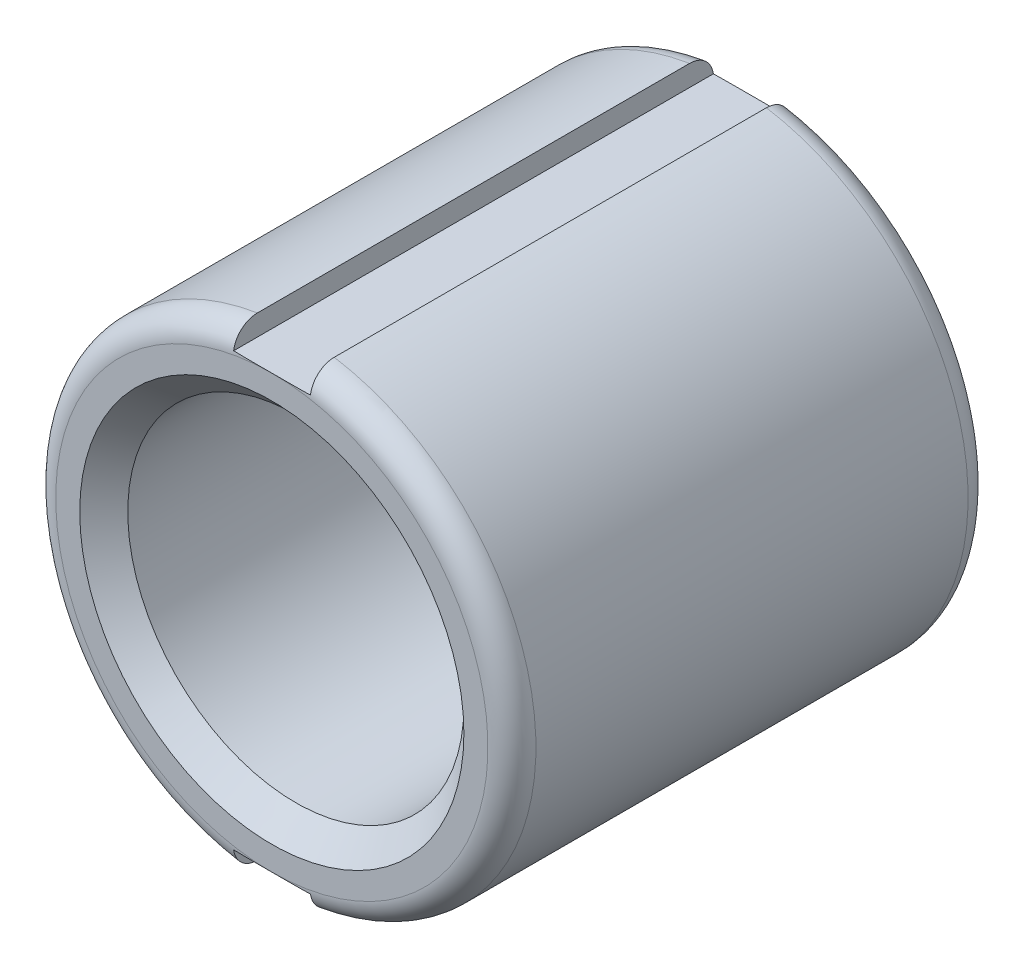
ISO-10303-21;
HEADER;
FILE_DESCRIPTION(('STEP AP214'),'2;1');
FILE_NAME('part.step','',(''),(''),'','','');
FILE_SCHEMA(('AUTOMOTIVE_DESIGN { 1 0 10303 214 1 1 1 1 }'));
ENDSEC;
DATA;
#1=APPLICATION_CONTEXT('core data for automotive mechanical design processes');
#2=APPLICATION_PROTOCOL_DEFINITION('international standard','automotive_design',2000,#1);
#3=PRODUCT_CONTEXT('',#1,'mechanical');
#4=PRODUCT('Part','Part','',(#3));
#5=PRODUCT_RELATED_PRODUCT_CATEGORY('part','',(#4));
#6=PRODUCT_DEFINITION_FORMATION('','',#4);
#7=PRODUCT_DEFINITION_CONTEXT('part definition',#1,'design');
#8=PRODUCT_DEFINITION('design','',#6,#7);
#9=PRODUCT_DEFINITION_SHAPE('','',#8);
#10=(LENGTH_UNIT() NAMED_UNIT(*) SI_UNIT(.MILLI.,.METRE.));
#11=(NAMED_UNIT(*) PLANE_ANGLE_UNIT() SI_UNIT($,.RADIAN.));
#12=(NAMED_UNIT(*) SI_UNIT($,.STERADIAN.) SOLID_ANGLE_UNIT());
#13=UNCERTAINTY_MEASURE_WITH_UNIT(LENGTH_MEASURE(1.E-05),#10,'distance_accuracy_value','');
#14=(GEOMETRIC_REPRESENTATION_CONTEXT(3) GLOBAL_UNCERTAINTY_ASSIGNED_CONTEXT((#13)) GLOBAL_UNIT_ASSIGNED_CONTEXT((#10,
#11,#12)) REPRESENTATION_CONTEXT('',''));
#15=CARTESIAN_POINT('',(0.,0.,0.));
#16=DIRECTION('',(0.,0.,1.));
#17=DIRECTION('',(1.,0.,0.));
#18=AXIS2_PLACEMENT_3D('',#15,#16,#17);
#19=CARTESIAN_POINT('',(0.,0.,0.));
#20=DIRECTION('',(0.,0.,1.));
#21=DIRECTION('',(1.,0.,0.));
#22=AXIS2_PLACEMENT_3D('',#19,#20,#21);
#23=CYLINDRICAL_SURFACE('',#22,3.5);
#24=CARTESIAN_POINT('',(0.,0.,0.500000668296252));
#25=DIRECTION('',(0.,0.,-1.));
#26=DIRECTION('',(-1.,0.,0.));
#27=AXIS2_PLACEMENT_3D('',#24,#25,#26);
#28=CIRCLE('',#27,3.50000155617636);
#29=CARTESIAN_POINT('',(-3.50000155617636,0.,0.500000668296252));
#30=VERTEX_POINT('',#29);
#31=EDGE_CURVE('E158',#30,#30,#28,.T.);
#32=ORIENTED_EDGE('',*,*,#31,.T.);
#33=EDGE_LOOP('',(#32));
#34=FACE_BOUND('',#33,.T.);
#35=CARTESIAN_POINT('',(0.,0.,9.49999933169465));
#36=DIRECTION('',(0.,0.,1.));
#37=DIRECTION('',(1.,0.,0.));
#38=AXIS2_PLACEMENT_3D('',#35,#36,#37);
#39=CIRCLE('',#38,3.50000155611951);
#40=CARTESIAN_POINT('',(3.50000155611951,0.,9.49999933169465));
#41=VERTEX_POINT('',#40);
#42=EDGE_CURVE('E109',#41,#41,#39,.T.);
#43=ORIENTED_EDGE('',*,*,#42,.T.);
#44=EDGE_LOOP('',(#43));
#45=FACE_BOUND('',#44,.T.);
#46=ADVANCED_FACE('F17',(#34,#45),#23,.F.);
#47=CARTESIAN_POINT('',(0.,0.,0.));
#48=DIRECTION('',(0.,0.,1.));
#49=DIRECTION('',(1.,0.,0.));
#50=AXIS2_PLACEMENT_3D('',#47,#48,#49);
#51=CYLINDRICAL_SURFACE('',#50,5.);
#52=CARTESIAN_POINT('',(0.,0.,9.5));
#53=DIRECTION('',(0.,0.,1.));
#54=DIRECTION('',(-0.999985814409762,0.0053264415179918,0.));
#55=AXIS2_PLACEMENT_3D('',#52,#53,#54);
#56=CIRCLE('',#55,5.);
#57=CARTESIAN_POINT('',(0.8,-4.93558507170123,9.5));
#58=VERTEX_POINT('',#57);
#59=CARTESIAN_POINT('',(0.8,4.93558507170123,9.5));
#60=VERTEX_POINT('',#59);
#61=EDGE_CURVE('E90',#58,#60,#56,.T.);
#62=ORIENTED_EDGE('',*,*,#61,.F.);
#63=DIRECTION('',(0.,0.,-1.));
#64=VECTOR('',#63,1.);
#65=CARTESIAN_POINT('',(0.8,-4.93558507170122,10.));
#66=LINE('',#65,#64);
#67=CARTESIAN_POINT('',(0.8,-4.93558507170123,0.5));
#68=VERTEX_POINT('',#67);
#69=EDGE_CURVE('E93',#58,#68,#66,.T.);
#70=ORIENTED_EDGE('',*,*,#69,.T.);
#71=CARTESIAN_POINT('',(0.,0.,0.5));
#72=DIRECTION('',(0.,0.,1.));
#73=DIRECTION('',(-0.999971373855159,-0.00756647012979169,0.));
#74=AXIS2_PLACEMENT_3D('',#71,#72,#73);
#75=CIRCLE('',#74,5.);
#76=CARTESIAN_POINT('',(0.8,4.93558507170123,0.5));
#77=VERTEX_POINT('',#76);
#78=EDGE_CURVE('E295',#77,#68,#75,.F.);
#79=ORIENTED_EDGE('',*,*,#78,.F.);
#80=DIRECTION('',(0.,0.,-1.));
#81=VECTOR('',#80,1.);
#82=CARTESIAN_POINT('',(0.8,4.93558507170122,10.));
#83=LINE('',#82,#81);
#84=EDGE_CURVE('E96',#77,#60,#83,.F.);
#85=ORIENTED_EDGE('',*,*,#84,.T.);
#86=EDGE_LOOP('',(#62,#70,#79,#85));
#87=FACE_BOUND('',#86,.T.);
#88=ADVANCED_FACE('F92',(#87),#51,.T.);
#89=CARTESIAN_POINT('',(0.8,-5.5,10.));
#90=DIRECTION('',(1.,0.,0.));
#91=DIRECTION('',(0.,0.,-1.));
#92=AXIS2_PLACEMENT_3D('',#89,#90,#91);
#93=PLANE('',#92);
#94=CARTESIAN_POINT('',(0.799999999999999,-4.93558507170123,0.5));
#95=CARTESIAN_POINT('',(0.799999999999999,-4.93561032535587,0.472142239938519));
#96=CARTESIAN_POINT('',(0.799999999999999,-4.9332280990744,0.444293560125993));
#97=CARTESIAN_POINT('',(0.8,-4.92383695020117,0.389416305297648));
#98=CARTESIAN_POINT('',(0.800000000000001,-4.91683289458156,0.362386898836657));
#99=CARTESIAN_POINT('',(0.800000000000001,-4.89838214932041,0.309878409520228));
#100=CARTESIAN_POINT('',(0.8,-4.88693378503542,0.28439991524956));
#101=CARTESIAN_POINT('',(0.8,-4.85994797345873,0.235717714075063));
#102=CARTESIAN_POINT('',(0.800000000000002,-4.84441127027912,0.212513594269689));
#103=CARTESIAN_POINT('',(0.800000000000002,-4.80960868399099,0.168890140455869));
#104=CARTESIAN_POINT('',(0.800000000000001,-4.79032319320717,0.148486455443453));
#105=CARTESIAN_POINT('',(0.799999999999999,-4.74863618241635,0.111157692405801));
#106=CARTESIAN_POINT('',(0.799999999999999,-4.72623435165118,0.0942329617157905));
#107=CARTESIAN_POINT('',(0.799999999999999,-4.67864143853591,0.0641049158333548));
#108=CARTESIAN_POINT('',(0.799999999999999,-4.65341750629682,0.0509535491889362));
#109=CARTESIAN_POINT('',(0.800000000000001,-4.6011736085027,0.0290311680150615));
#110=CARTESIAN_POINT('',(0.800000000000002,-4.5741565608496,0.0202532255802647));
#111=CARTESIAN_POINT('',(0.800000000000001,-4.53121938397591,0.0101181231965108));
#112=CARTESIAN_POINT('',(0.800000000000001,-4.51565627527713,0.0071954524475714));
#113=CARTESIAN_POINT('',(0.799999999999999,-4.5,0.00500345930988489));
#114=B_SPLINE_CURVE_WITH_KNOTS('',3,(#94,#95,#96,#97,#98,#99,#100,#101,#102,#103,#104,#105,#106,
#107,#108,#109,#110,#111,#112,#113),.UNSPECIFIED.,.F.,.F.,(4,2,2,2,2,2,2,2,2,4),(0.,
0.0834582261465901,0.166828707373061,0.2502306336609,0.333617390583446,0.417452636878405,
0.501296249137186,0.586244120600249,0.671056995563331,0.718490993678133),.UNSPECIFIED.);
#115=CARTESIAN_POINT('',(0.8,-4.5,0.00500345930988505));
#116=VERTEX_POINT('',#115);
#117=EDGE_CURVE('E107',#68,#116,#114,.T.);
#118=ORIENTED_EDGE('',*,*,#117,.F.);
#119=ORIENTED_EDGE('',*,*,#69,.F.);
#120=CARTESIAN_POINT('',(0.799999999999999,-4.50000000000001,9.99499654069011));
#121=CARTESIAN_POINT('',(0.800000000003339,-4.52845008995948,9.99102726234701));
#122=CARTESIAN_POINT('',(0.80000000000206,-4.55655799753854,9.98463378322027));
#123=CARTESIAN_POINT('',(0.79999999999794,-4.611312990404,9.96725562326724));
#124=CARTESIAN_POINT('',(0.799999999995099,-4.63796026705732,9.95627154551976));
#125=CARTESIAN_POINT('',(0.799999999995528,-4.68904531495508,9.92995796288271));
#126=CARTESIAN_POINT('',(0.799999999998802,-4.7134813483106,9.91462507858352));
#127=CARTESIAN_POINT('',(0.800000000001197,-4.75938912980065,9.88004391144214));
#128=CARTESIAN_POINT('',(0.800000000000321,-4.78086227872704,9.86079748956176));
#129=CARTESIAN_POINT('',(0.799999999999685,-4.82002026059259,9.8191179415494));
#130=CARTESIAN_POINT('',(0.799999999999915,-4.83773905813528,9.79671673527788));
#131=CARTESIAN_POINT('',(0.800000000000085,-4.86910243522778,9.74922441106862));
#132=CARTESIAN_POINT('',(0.800000000000024,-4.88274752932843,9.7241336333961));
#133=CARTESIAN_POINT('',(0.79999999999998,-4.90540197180442,9.67231304598103));
#134=CARTESIAN_POINT('',(0.799999999999995,-4.9144665136445,9.64560731737832));
#135=CARTESIAN_POINT('',(0.800000000000005,-4.92791606131762,9.59108622263885));
#136=CARTESIAN_POINT('',(0.799999999999999,-4.93231064733838,9.56327325011705));
#137=CARTESIAN_POINT('',(0.799999999999998,-4.93516503994077,9.52355829081837));
#138=CARTESIAN_POINT('',(0.799999999999998,-4.93558824722471,9.51177579488754));
#139=CARTESIAN_POINT('',(0.800000000000001,-4.93558507170123,9.5));
#140=B_SPLINE_CURVE_WITH_KNOTS('',3,(#120,#121,#122,#123,#124,#125,#126,#127,#128,#129,#130,
#131,#132,#133,#134,#135,#136,#137,#138,#139),.UNSPECIFIED.,.F.,.F.,(4,2,2,2,2,2,2,2,2,4),(0.,
0.0860724300575327,0.172133556110195,0.25826174341409,0.344349070497942,0.429620769168096,
0.514881692580213,0.599089183650414,0.683123591666845,0.718461359070084),.UNSPECIFIED.);
#141=CARTESIAN_POINT('',(0.800000000000001,-4.5,9.99499654069011));
#142=VERTEX_POINT('',#141);
#143=EDGE_CURVE('E101',#142,#58,#140,.T.);
#144=ORIENTED_EDGE('',*,*,#143,.F.);
#145=DIRECTION('',(0.,0.,1.));
#146=VECTOR('',#145,1.);
#147=CARTESIAN_POINT('',(0.800000000000002,-4.5,10.));
#148=LINE('',#147,#146);
#149=EDGE_CURVE('E294',#142,#116,#148,.F.);
#150=ORIENTED_EDGE('',*,*,#149,.T.);
#151=EDGE_LOOP('',(#118,#119,#144,#150));
#152=FACE_BOUND('',#151,.T.);
#153=ADVANCED_FACE('F104',(#152),#93,.F.);
#154=CARTESIAN_POINT('',(0.,0.,9.99999999993406));
#155=DIRECTION('',(0.,0.,1.));
#156=DIRECTION('',(1.,0.,0.));
#157=AXIS2_PLACEMENT_3D('',#154,#155,#156);
#158=CONICAL_SURFACE('',#157,4.00000254199995,0.785398481094791);
#159=ORIENTED_EDGE('',*,*,#42,.F.);
#160=EDGE_LOOP('',(#159));
#161=FACE_BOUND('',#160,.T.);
#162=CARTESIAN_POINT('',(0.,0.,9.99999999999091));
#163=DIRECTION('',(0.,0.,1.));
#164=DIRECTION('',(1.,0.,0.));
#165=AXIS2_PLACEMENT_3D('',#162,#163,#164);
#166=CIRCLE('',#165,4.00000254205679);
#167=CARTESIAN_POINT('',(4.00000254205679,0.,9.99999999999091));
#168=VERTEX_POINT('',#167);
#169=EDGE_CURVE('E348',#168,#168,#166,.F.);
#170=ORIENTED_EDGE('',*,*,#169,.F.);
#171=EDGE_LOOP('',(#170));
#172=FACE_BOUND('',#171,.T.);
#173=ADVANCED_FACE('F136',(#161,#172),#158,.F.);
#174=CARTESIAN_POINT('',(0.,0.,9.5));
#175=DIRECTION('',(0.,0.,1.));
#176=DIRECTION('',(-0.999985814409762,0.0053264415179918,0.));
#177=AXIS2_PLACEMENT_3D('',#174,#175,#176);
#178=TOROIDAL_SURFACE('',#177,4.5,0.5);
#179=ORIENTED_EDGE('',*,*,#61,.T.);
#180=CARTESIAN_POINT('',(0.800000000000001,4.93558507170123,9.5));
#181=CARTESIAN_POINT('',(0.800000000000001,4.93561032535586,9.52785776006148));
#182=CARTESIAN_POINT('',(0.800000000000001,4.9332280990744,9.55570643987401));
#183=CARTESIAN_POINT('',(0.799999999999999,4.92383695020116,9.61058369470235));
#184=CARTESIAN_POINT('',(0.799999999999999,4.91683289458156,9.63761310116334));
#185=CARTESIAN_POINT('',(0.799999999999999,4.8983821493204,9.69012159047977));
#186=CARTESIAN_POINT('',(0.800000000000001,4.88693378503541,9.71560008475044));
#187=CARTESIAN_POINT('',(0.799999999999999,4.85994797345873,9.76428228592494));
#188=CARTESIAN_POINT('',(0.799999999999996,4.84441127027911,9.78748640573031));
#189=CARTESIAN_POINT('',(0.799999999999995,4.80960868399099,9.83110985954413));
#190=CARTESIAN_POINT('',(0.799999999999998,4.79032319320717,9.85151354455655));
#191=CARTESIAN_POINT('',(0.800000000000002,4.74863618241635,9.8888423075942));
#192=CARTESIAN_POINT('',(0.800000000000003,4.72623435165118,9.90576703828421));
#193=CARTESIAN_POINT('',(0.800000000000002,4.67864143853591,9.93589508416664));
#194=CARTESIAN_POINT('',(0.799999999999999,4.65341750629682,9.94904645081106));
#195=CARTESIAN_POINT('',(0.8,4.6011736085027,9.97096883198494));
#196=CARTESIAN_POINT('',(0.800000000000004,4.5741565608496,9.97974677441973));
#197=CARTESIAN_POINT('',(0.800000000000004,4.53121938397591,9.98988187680349));
#198=CARTESIAN_POINT('',(0.800000000000003,4.51565627527713,9.99280454755243));
#199=CARTESIAN_POINT('',(0.8,4.50000000000001,9.99499654069011));
#200=B_SPLINE_CURVE_WITH_KNOTS('',3,(#180,#181,#182,#183,#184,#185,#186,#187,#188,#189,#190,
#191,#192,#193,#194,#195,#196,#197,#198,#199),.UNSPECIFIED.,.F.,.F.,(4,2,2,2,2,2,2,2,2,4),(0.,
0.0834582261465907,0.166828707373061,0.2502306336609,0.333617390583446,0.417452636878405,
0.501296249137185,0.586244120600247,0.671056995563331,0.718490993678126),.UNSPECIFIED.);
#201=CARTESIAN_POINT('',(0.800000000000001,4.5,9.99499654069011));
#202=VERTEX_POINT('',#201);
#203=EDGE_CURVE('E124',#60,#202,#200,.T.);
#204=ORIENTED_EDGE('',*,*,#203,.T.);
#205=CARTESIAN_POINT('',(0.800000000000002,4.5,9.99499654069012));
#206=CARTESIAN_POINT('',(0.733344461334272,4.5,9.99663365195973));
#207=CARTESIAN_POINT('',(0.666680461312616,4.5,9.99770096514002));
#208=CARTESIAN_POINT('',(0.533346087742878,4.5,9.99912184018491));
#209=CARTESIAN_POINT('',(0.466675714444805,4.5,9.9994754233789));
#210=CARTESIAN_POINT('',(0.333336097882169,4.5,9.99989472730253));
#211=CARTESIAN_POINT('',(0.26666685461492,4.5,9.99996045208806));
#212=CARTESIAN_POINT('',(0.133326303280786,4.5,10.0000000824359));
#213=CARTESIAN_POINT('',(0.066654995211742,4.5,9.99997398525395));
#214=CARTESIAN_POINT('',(-1.64804799254942E-05,4.5,10.));
#215=B_SPLINE_CURVE_WITH_KNOTS('',3,(#205,#206,#207,#208,#209,#210,#211,#212,#213,#214),
.UNSPECIFIED.,.F.,.F.,(4,2,2,2,4),(0.,0.200016874708182,0.400027771944378,0.60003585104753,
0.80004990770689),.UNSPECIFIED.);
#216=CARTESIAN_POINT('',(-1.64804799263147E-05,4.50000021942539,9.99999999999994));
#217=VERTEX_POINT('',#216);
#218=EDGE_CURVE('E116',#202,#217,#215,.T.);
#219=ORIENTED_EDGE('',*,*,#218,.T.);
#220=CARTESIAN_POINT('',(0.,0.,9.99999999999991));
#221=DIRECTION('',(0.,0.,-1.));
#222=DIRECTION('',(-3.66232863427582E-06,0.999999999993293,0.));
#223=AXIS2_PLACEMENT_3D('',#220,#221,#222);
#224=CIRCLE('',#223,4.50000029300371);
#225=CARTESIAN_POINT('',(1.62758198530875E-05,-4.50000021820692,9.99999999999994));
#226=VERTEX_POINT('',#225);
#227=EDGE_CURVE('E149',#226,#217,#224,.F.);
#228=ORIENTED_EDGE('',*,*,#227,.F.);
#229=CARTESIAN_POINT('',(1.62758198533338E-05,-4.5,10.));
#230=CARTESIAN_POINT('',(0.0666850218145762,-4.5,9.99997398959712));
#231=CARTESIAN_POINT('',(0.133353600268118,-4.5,10.000000082437));
#232=CARTESIAN_POINT('',(0.266688692360293,-4.5,9.99996043270109));
#233=CARTESIAN_POINT('',(0.333355206001086,-4.5,9.99989469286998));
#234=CARTESIAN_POINT('',(0.466689363027923,-4.5,9.99947535481787));
#235=CARTESIAN_POINT('',(0.533357006416649,-4.5,9.99912175254108));
#236=CARTESIAN_POINT('',(0.666685920379369,-4.5,9.99770087981886));
#237=CARTESIAN_POINT('',(0.733347190703352,-4.5,9.99663358804452));
#238=CARTESIAN_POINT('',(0.800000000000001,-4.5,9.99499654069012));
#239=B_SPLINE_CURVE_WITH_KNOTS('',3,(#229,#230,#231,#232,#233,#234,#235,#236,#237,#238),
.UNSPECIFIED.,.F.,.F.,(4,2,2,2,4),(0.,0.200005867720801,0.400005757922168,0.600008466035796,
0.800017151584641),.UNSPECIFIED.);
#240=EDGE_CURVE('E114',#226,#142,#239,.T.);
#241=ORIENTED_EDGE('',*,*,#240,.T.);
#242=ORIENTED_EDGE('',*,*,#143,.T.);
#243=EDGE_LOOP('',(#179,#204,#219,#228,#241,#242));
#244=FACE_BOUND('',#243,.T.);
#245=ADVANCED_FACE('F111',(#244),#178,.T.);
#246=CARTESIAN_POINT('',(0.8,4.5,10.));
#247=DIRECTION('',(1.,0.,0.));
#248=DIRECTION('',(0.,0.,-1.));
#249=AXIS2_PLACEMENT_3D('',#246,#247,#248);
#250=PLANE('',#249);
#251=ORIENTED_EDGE('',*,*,#203,.F.);
#252=ORIENTED_EDGE('',*,*,#84,.F.);
#253=CARTESIAN_POINT('',(0.8,4.5,0.00500345930988478));
#254=CARTESIAN_POINT('',(0.800000000003342,4.52845008995948,0.0089727376529909));
#255=CARTESIAN_POINT('',(0.800000000002062,4.55655799753853,0.0153662167797315));
#256=CARTESIAN_POINT('',(0.799999999997939,4.611312990404,0.0327443767327543));
#257=CARTESIAN_POINT('',(0.799999999995096,4.63796026705732,0.0437284544802352));
#258=CARTESIAN_POINT('',(0.799999999995525,4.68904531495508,0.0700420371172882));
#259=CARTESIAN_POINT('',(0.799999999998801,4.7134813483106,0.0853749214164788));
#260=CARTESIAN_POINT('',(0.800000000001198,4.75938912980065,0.119956088557856));
#261=CARTESIAN_POINT('',(0.80000000000032,4.78086227872704,0.139202510438233));
#262=CARTESIAN_POINT('',(0.799999999999684,4.82002026059259,0.180882058450603));
#263=CARTESIAN_POINT('',(0.799999999999915,4.83773905813528,0.203283264722114));
#264=CARTESIAN_POINT('',(0.800000000000085,4.86910243522778,0.250775588931374));
#265=CARTESIAN_POINT('',(0.800000000000024,4.88274752932843,0.275866366603897));
#266=CARTESIAN_POINT('',(0.799999999999979,4.90540197180442,0.327686954018964));
#267=CARTESIAN_POINT('',(0.799999999999993,4.9144665136445,0.354392682621678));
#268=CARTESIAN_POINT('',(0.800000000000007,4.92791606131762,0.40891377736115));
#269=CARTESIAN_POINT('',(0.800000000000005,4.93231064733838,0.436726749882947));
#270=CARTESIAN_POINT('',(0.800000000000001,4.93516503994077,0.476441709181632));
#271=CARTESIAN_POINT('',(0.8,4.93558824722471,0.488224205112462));
#272=CARTESIAN_POINT('',(0.799999999999999,4.93558507170123,0.5));
#273=B_SPLINE_CURVE_WITH_KNOTS('',3,(#253,#254,#255,#256,#257,#258,#259,#260,#261,#262,#263,
#264,#265,#266,#267,#268,#269,#270,#271,#272),.UNSPECIFIED.,.F.,.F.,(4,2,2,2,2,2,2,2,2,4),(0.,
0.0860724300575342,0.172133556110198,0.258261743414094,0.344349070497948,0.429620769168102,
0.514881692580217,0.599089183650419,0.68312359166685,0.718461359070095),.UNSPECIFIED.);
#274=CARTESIAN_POINT('',(0.8,4.5,0.00500345930988478));
#275=VERTEX_POINT('',#274);
#276=EDGE_CURVE('E161',#275,#77,#273,.T.);
#277=ORIENTED_EDGE('',*,*,#276,.F.);
#278=DIRECTION('',(0.,0.,-1.));
#279=VECTOR('',#278,1.);
#280=CARTESIAN_POINT('',(0.8,4.5,10.));
#281=LINE('',#280,#279);
#282=EDGE_CURVE('E356',#275,#202,#281,.F.);
#283=ORIENTED_EDGE('',*,*,#282,.T.);
#284=EDGE_LOOP('',(#251,#252,#277,#283));
#285=FACE_BOUND('',#284,.T.);
#286=ADVANCED_FACE('F135',(#285),#250,.F.);
#287=CARTESIAN_POINT('',(0.,0.,5.6843418860808E-11));
#288=DIRECTION('',(0.,0.,-1.));
#289=DIRECTION('',(-1.,0.,0.));
#290=AXIS2_PLACEMENT_3D('',#287,#288,#289);
#291=CONICAL_SURFACE('',#290,4.00000254217048,0.785398481151634);
#292=ORIENTED_EDGE('',*,*,#31,.F.);
#293=EDGE_LOOP('',(#292));
#294=FACE_BOUND('',#293,.T.);
#295=CARTESIAN_POINT('',(0.,0.,5.6843418860808E-11));
#296=DIRECTION('',(0.,0.,-1.));
#297=DIRECTION('',(-1.,0.,0.));
#298=AXIS2_PLACEMENT_3D('',#295,#296,#297);
#299=CIRCLE('',#298,4.00000254217048);
#300=CARTESIAN_POINT('',(-4.00000254217048,0.,5.6843418860808E-11));
#301=VERTEX_POINT('',#300);
#302=EDGE_CURVE('E261',#301,#301,#299,.T.);
#303=ORIENTED_EDGE('',*,*,#302,.T.);
#304=EDGE_LOOP('',(#303));
#305=FACE_BOUND('',#304,.T.);
#306=ADVANCED_FACE('F288',(#294,#305),#291,.F.);
#307=CARTESIAN_POINT('',(0.,0.,0.5));
#308=DIRECTION('',(0.,0.,1.));
#309=DIRECTION('',(-0.999971373855159,-0.00756647012979169,0.));
#310=AXIS2_PLACEMENT_3D('',#307,#308,#309);
#311=TOROIDAL_SURFACE('',#310,4.5,0.5);
#312=CARTESIAN_POINT('',(0.799999999999999,-4.5,0.00500345930988467));
#313=CARTESIAN_POINT('',(0.733345836201673,-4.5,0.00336638023626906));
#314=CARTESIAN_POINT('',(0.666683211212941,-4.5,0.00229907783861924));
#315=CARTESIAN_POINT('',(0.533351587815675,-4.5,0.000878203963372319));
#316=CARTESIAN_POINT('',(0.466682589657151,-4.5,0.000524611156621396));
#317=CARTESIAN_POINT('',(0.333345723231111,-4.5,0.000105290041417163));
#318=CARTESIAN_POINT('',(0.26667785496091,-4.5,3.95576771291826E-05));
#319=CARTESIAN_POINT('',(0.133340053615356,-4.5,-8.24366977575884E-08));
#320=CARTESIAN_POINT('',(0.0666701205378419,-4.5,2.60125581932159E-05));
#321=CARTESIAN_POINT('',(1.98787304230897E-08,-4.5,0.));
#322=B_SPLINE_CURVE_WITH_KNOTS('',3,(#312,#313,#314,#315,#316,#317,#318,#319,#320,#321),
.UNSPECIFIED.,.F.,.F.,(4,2,2,2,4),(0.,0.200012749576009,0.400019521698549,0.600023475799261,
0.80003340743766),.UNSPECIFIED.);
#323=CARTESIAN_POINT('',(1.98787300884372E-08,-4.50000000014344,0.));
#324=VERTEX_POINT('',#323);
#325=EDGE_CURVE('E339',#116,#324,#322,.T.);
#326=ORIENTED_EDGE('',*,*,#325,.T.);
#327=CARTESIAN_POINT('',(0.,0.,0.));
#328=DIRECTION('',(0.,0.,1.));
#329=DIRECTION('',(4.41749556354919E-09,-1.,0.));
#330=AXIS2_PLACEMENT_3D('',#327,#328,#329);
#331=CIRCLE('',#330,4.50000000019725);
#332=CARTESIAN_POINT('',(4.50000000008891,0.,0.));
#333=VERTEX_POINT('',#332);
#334=EDGE_CURVE('E253',#324,#333,#331,.T.);
#335=ORIENTED_EDGE('',*,*,#334,.T.);
#336=CARTESIAN_POINT('',(0.,0.,0.));
#337=DIRECTION('',(0.,0.,1.));
#338=DIRECTION('',(1.,0.,0.));
#339=AXIS2_PLACEMENT_3D('',#336,#337,#338);
#340=CIRCLE('',#339,4.5000000000528);
#341=CARTESIAN_POINT('',(-2.20444814632359E-08,4.50000000010738,0.));
#342=VERTEX_POINT('',#341);
#343=EDGE_CURVE('E247',#333,#342,#340,.T.);
#344=ORIENTED_EDGE('',*,*,#343,.T.);
#345=CARTESIAN_POINT('',(-2.20444806072612E-08,4.5,0.));
#346=CARTESIAN_POINT('',(0.0666700821082385,4.5,2.60125637518218E-05));
#347=CARTESIAN_POINT('',(0.133340018679256,4.5,-8.24366963839623E-08));
#348=CARTESIAN_POINT('',(0.266677827011831,4.5,3.95576523166573E-05));
#349=CARTESIAN_POINT('',(0.33334569877555,4.5,0.000105289997348502));
#350=CARTESIAN_POINT('',(0.466682572188987,4.5,0.000524611068873394));
#351=CARTESIAN_POINT('',(0.53335157384139,4.5,0.000878203851201231));
#352=CARTESIAN_POINT('',(0.666683204226145,4.5,0.00229907772942093));
#353=CARTESIAN_POINT('',(0.733345832708486,4.5,0.00336638015446722));
#354=CARTESIAN_POINT('',(0.8,4.5,0.00500345930988478));
#355=B_SPLINE_CURVE_WITH_KNOTS('',3,(#345,#346,#347,#348,#349,#350,#351,#352,#353,#354),
.UNSPECIFIED.,.F.,.F.,(4,2,2,2,4),(0.,0.200009942119028,0.40001390670032,0.600020689303724,
0.800033449360644),.UNSPECIFIED.);
#356=EDGE_CURVE('E266',#342,#275,#355,.T.);
#357=ORIENTED_EDGE('',*,*,#356,.T.);
#358=ORIENTED_EDGE('',*,*,#276,.T.);
#359=ORIENTED_EDGE('',*,*,#78,.T.);
#360=ORIENTED_EDGE('',*,*,#117,.T.);
#361=EDGE_LOOP('',(#326,#335,#344,#357,#358,#359,#360));
#362=FACE_BOUND('',#361,.T.);
#363=ADVANCED_FACE('F282',(#362),#311,.T.);
#364=CARTESIAN_POINT('',(0.8,-4.5,10.));
#365=DIRECTION('',(0.,1.,0.));
#366=DIRECTION('',(0.,0.,1.));
#367=AXIS2_PLACEMENT_3D('',#364,#365,#366);
#368=PLANE('',#367);
#369=ORIENTED_EDGE('',*,*,#325,.F.);
#370=ORIENTED_EDGE('',*,*,#149,.F.);
#371=ORIENTED_EDGE('',*,*,#240,.F.);
#372=CARTESIAN_POINT('',(-0.800000000000002,-4.5,9.99499654069012));
#373=CARTESIAN_POINT('',(-0.733344478387262,-4.5,9.99663365156039));
#374=CARTESIAN_POINT('',(-0.66668049542065,-4.5,9.99770096460694));
#375=CARTESIAN_POINT('',(-0.533346155962323,-4.5,9.99912183963733));
#376=CARTESIAN_POINT('',(-0.466675799720616,-4.5,9.99947542295055));
#377=CARTESIAN_POINT('',(-0.333336217268945,-4.5,9.99989472708742));
#378=CARTESIAN_POINT('',(-0.266666991056294,-4.5,9.99996045196694));
#379=CARTESIAN_POINT('',(-0.13332647383129,-4.5,10.0000000824359));
#380=CARTESIAN_POINT('',(-0.0666551828167758,-4.5,9.99997398528108));
#381=CARTESIAN_POINT('',(1.62758198524665E-05,-4.5,10.));
#382=B_SPLINE_CURVE_WITH_KNOTS('',3,(#372,#373,#374,#375,#376,#377,#378,#379,#380,#381),
.UNSPECIFIED.,.F.,.F.,(4,2,2,2,4),(0.,0.200016823542637,0.400027669613517,0.600035697552733,
0.800049703047926),.UNSPECIFIED.);
#383=CARTESIAN_POINT('',(-0.800000000000001,-4.5,9.99499654069011));
#384=VERTEX_POINT('',#383);
#385=EDGE_CURVE('E314',#384,#226,#382,.T.);
#386=ORIENTED_EDGE('',*,*,#385,.F.);
#387=DIRECTION('',(0.,0.,1.));
#388=VECTOR('',#387,1.);
#389=CARTESIAN_POINT('',(-0.8,-4.50000000000001,10.));
#390=LINE('',#389,#388);
#391=CARTESIAN_POINT('',(-0.8,-4.5,0.00500345930988505));
#392=VERTEX_POINT('',#391);
#393=EDGE_CURVE('E205',#384,#392,#390,.F.);
#394=ORIENTED_EDGE('',*,*,#393,.T.);
#395=CARTESIAN_POINT('',(1.98787286883662E-08,-4.5,0.));
#396=CARTESIAN_POINT('',(-0.0666700840935108,-4.5,2.6012563464641E-05));
#397=CARTESIAN_POINT('',(-0.133340020484054,-4.5,-8.24366964687947E-08));
#398=CARTESIAN_POINT('',(-0.26667782845568,-4.5,3.95576535984809E-05));
#399=CARTESIAN_POINT('',(-0.333345700038923,-4.5,0.000105289999625111));
#400=CARTESIAN_POINT('',(-0.466682573091392,-4.5,0.000524611073406447));
#401=CARTESIAN_POINT('',(-0.533351574563302,-4.5,0.000878203856995937));
#402=CARTESIAN_POINT('',(-0.666683204587083,-4.5,0.002299077735062));
#403=CARTESIAN_POINT('',(-0.733345832888944,-4.5,0.00336638015869296));
#404=CARTESIAN_POINT('',(-0.8,-4.5,0.00500345930988467));
#405=B_SPLINE_CURVE_WITH_KNOTS('',3,(#395,#396,#397,#398,#399,#400,#401,#402,#403,#404),
.UNSPECIFIED.,.F.,.F.,(4,2,2,2,4),(0.,0.200009941577599,0.400013905617465,0.600020687679428,
0.800033447194904),.UNSPECIFIED.);
#406=EDGE_CURVE('E341',#324,#392,#405,.T.);
#407=ORIENTED_EDGE('',*,*,#406,.F.);
#408=EDGE_LOOP('',(#369,#370,#371,#386,#394,#407));
#409=FACE_BOUND('',#408,.T.);
#410=ADVANCED_FACE('F287',(#409),#368,.F.);
#411=CARTESIAN_POINT('',(0.,0.,10.));
#412=DIRECTION('',(0.,0.,1.));
#413=DIRECTION('',(1.,0.,0.));
#414=AXIS2_PLACEMENT_3D('',#411,#412,#413);
#415=PLANE('',#414);
#416=ORIENTED_EDGE('',*,*,#227,.T.);
#417=CARTESIAN_POINT('',(0.,0.,9.99999999999991));
#418=DIRECTION('',(0.,0.,-1.));
#419=DIRECTION('',(3.61684862251804E-06,-0.999999999993459,0.));
#420=AXIS2_PLACEMENT_3D('',#417,#418,#419);
#421=CIRCLE('',#420,4.50000029056565);
#422=EDGE_CURVE('E241',#226,#217,#421,.T.);
#423=ORIENTED_EDGE('',*,*,#422,.F.);
#424=EDGE_LOOP('',(#416,#423));
#425=FACE_BOUND('',#424,.T.);
#426=ORIENTED_EDGE('',*,*,#169,.T.);
#427=EDGE_LOOP('',(#426));
#428=FACE_BOUND('',#427,.T.);
#429=ADVANCED_FACE('F373',(#425,#428),#415,.T.);
#430=CARTESIAN_POINT('',(-0.8,4.5,10.));
#431=DIRECTION('',(0.,-1.,0.));
#432=DIRECTION('',(0.,0.,-1.));
#433=AXIS2_PLACEMENT_3D('',#430,#431,#432);
#434=PLANE('',#433);
#435=CARTESIAN_POINT('',(-0.799999999999999,4.5,0.00500345930988467));
#436=CARTESIAN_POINT('',(-0.733345836382131,4.5,0.00336638024049498));
#437=CARTESIAN_POINT('',(-0.666683211573879,4.5,0.00229907784426046));
#438=CARTESIAN_POINT('',(-0.533351588537586,4.5,0.000878203969167085));
#439=CARTESIAN_POINT('',(-0.466682590559555,4.5,0.000524611161154444));
#440=CARTESIAN_POINT('',(-0.333345724494484,4.5,0.000105290043693719));
#441=CARTESIAN_POINT('',(-0.266677856404758,4.5,3.95576784109719E-05));
#442=CARTESIAN_POINT('',(-0.133340055420153,4.5,-8.24366978394263E-08));
#443=CARTESIAN_POINT('',(-0.0666701225231134,4.5,2.60125579060572E-05));
#444=CARTESIAN_POINT('',(-2.20444814678466E-08,4.5,0.));
#445=B_SPLINE_CURVE_WITH_KNOTS('',3,(#435,#436,#437,#438,#439,#440,#441,#442,#443,#444),
.UNSPECIFIED.,.F.,.F.,(4,2,2,2,4),(0.,0.200012749034566,0.400019520615665,0.60002347417495,
0.800033405271921),.UNSPECIFIED.);
#446=CARTESIAN_POINT('',(-0.8,4.5,0.005003459309885));
#447=VERTEX_POINT('',#446);
#448=EDGE_CURVE('E269',#447,#342,#445,.T.);
#449=ORIENTED_EDGE('',*,*,#448,.F.);
#450=DIRECTION('',(0.,0.,1.));
#451=VECTOR('',#450,1.);
#452=CARTESIAN_POINT('',(-0.8,4.5,10.));
#453=LINE('',#452,#451);
#454=CARTESIAN_POINT('',(-0.8,4.5,9.99499654069011));
#455=VERTEX_POINT('',#454);
#456=EDGE_CURVE('E197',#447,#455,#453,.T.);
#457=ORIENTED_EDGE('',*,*,#456,.T.);
#458=CARTESIAN_POINT('',(-1.6480479926365E-05,4.5,10.));
#459=CARTESIAN_POINT('',(-0.0666852094196099,4.5,9.99997398962426));
#460=CARTESIAN_POINT('',(-0.133353770818622,4.5,10.000000082437));
#461=CARTESIAN_POINT('',(-0.266688828801667,4.5,9.99996043257995));
#462=CARTESIAN_POINT('',(-0.333355325387862,4.5,9.99989469265483));
#463=CARTESIAN_POINT('',(-0.466689448303733,4.5,9.99947535438948));
#464=CARTESIAN_POINT('',(-0.533357074636092,4.5,9.99912175199347));
#465=CARTESIAN_POINT('',(-0.666685954487403,4.5,9.99770087928578));
#466=CARTESIAN_POINT('',(-0.733347207756341,4.5,9.99663358764518));
#467=CARTESIAN_POINT('',(-0.8,4.5,9.99499654069012));
#468=B_SPLINE_CURVE_WITH_KNOTS('',3,(#458,#459,#460,#461,#462,#463,#464,#465,#466,#467),
.UNSPECIFIED.,.F.,.F.,(4,2,2,2,4),(0.,0.200005816556635,0.400005655594065,0.600008312542377,
0.800016946925676),.UNSPECIFIED.);
#469=EDGE_CURVE('E240',#217,#455,#468,.T.);
#470=ORIENTED_EDGE('',*,*,#469,.F.);
#471=ORIENTED_EDGE('',*,*,#218,.F.);
#472=ORIENTED_EDGE('',*,*,#282,.F.);
#473=ORIENTED_EDGE('',*,*,#356,.F.);
#474=EDGE_LOOP('',(#449,#457,#470,#471,#472,#473));
#475=FACE_BOUND('',#474,.T.);
#476=ADVANCED_FACE('F279',(#475),#434,.F.);
#477=CARTESIAN_POINT('',(0.,0.,0.));
#478=DIRECTION('',(0.,0.,1.));
#479=DIRECTION('',(1.,0.,0.));
#480=AXIS2_PLACEMENT_3D('',#477,#478,#479);
#481=PLANE('',#480);
#482=ORIENTED_EDGE('',*,*,#334,.F.);
#483=CARTESIAN_POINT('',(0.,0.,0.));
#484=DIRECTION('',(0.,0.,1.));
#485=DIRECTION('',(-4.89877391383228E-09,1.,0.));
#486=AXIS2_PLACEMENT_3D('',#483,#484,#485);
#487=CIRCLE('',#486,4.50000000016125);
#488=EDGE_CURVE('E170',#342,#324,#487,.T.);
#489=ORIENTED_EDGE('',*,*,#488,.F.);
#490=ORIENTED_EDGE('',*,*,#343,.F.);
#491=EDGE_LOOP('',(#482,#489,#490));
#492=FACE_BOUND('',#491,.T.);
#493=ORIENTED_EDGE('',*,*,#302,.F.);
#494=EDGE_LOOP('',(#493));
#495=FACE_BOUND('',#494,.T.);
#496=ADVANCED_FACE('F394',(#492,#495),#481,.F.);
#497=CARTESIAN_POINT('',(-0.8,-4.5,10.));
#498=DIRECTION('',(-1.,0.,0.));
#499=DIRECTION('',(0.,0.,1.));
#500=AXIS2_PLACEMENT_3D('',#497,#498,#499);
#501=PLANE('',#500);
#502=CARTESIAN_POINT('',(-0.800000000000001,-4.93558507170123,9.5));
#503=CARTESIAN_POINT('',(-0.800000000000001,-4.93561032535586,9.52785776006148));
#504=CARTESIAN_POINT('',(-0.800000000000001,-4.9332280990744,9.55570643987401));
#505=CARTESIAN_POINT('',(-0.799999999999999,-4.92383695020116,9.61058369470235));
#506=CARTESIAN_POINT('',(-0.799999999999999,-4.91683289458156,9.63761310116334));
#507=CARTESIAN_POINT('',(-0.799999999999999,-4.8983821493204,9.69012159047977));
#508=CARTESIAN_POINT('',(-0.800000000000001,-4.88693378503541,9.71560008475044));
#509=CARTESIAN_POINT('',(-0.799999999999999,-4.85994797345873,9.76428228592494));
#510=CARTESIAN_POINT('',(-0.799999999999996,-4.84441127027911,9.78748640573031));
#511=CARTESIAN_POINT('',(-0.799999999999995,-4.80960868399099,9.83110985954413));
#512=CARTESIAN_POINT('',(-0.799999999999998,-4.79032319320717,9.85151354455655));
#513=CARTESIAN_POINT('',(-0.800000000000002,-4.74863618241635,9.8888423075942));
#514=CARTESIAN_POINT('',(-0.800000000000003,-4.72623435165118,9.90576703828421));
#515=CARTESIAN_POINT('',(-0.800000000000002,-4.67864143853591,9.93589508416664));
#516=CARTESIAN_POINT('',(-0.799999999999999,-4.65341750629682,9.94904645081106));
#517=CARTESIAN_POINT('',(-0.800000000000001,-4.6011736085027,9.97096883198494));
#518=CARTESIAN_POINT('',(-0.800000000000005,-4.5741565608496,9.97974677441973));
#519=CARTESIAN_POINT('',(-0.800000000000004,-4.53121938397591,9.98988187680349));
#520=CARTESIAN_POINT('',(-0.800000000000002,-4.51565627527713,9.99280454755243));
#521=CARTESIAN_POINT('',(-0.799999999999998,-4.5,9.99499654069012));
#522=B_SPLINE_CURVE_WITH_KNOTS('',3,(#502,#503,#504,#505,#506,#507,#508,#509,#510,#511,#512,
#513,#514,#515,#516,#517,#518,#519,#520,#521),.UNSPECIFIED.,.F.,.F.,(4,2,2,2,2,2,2,2,2,4),(0.,
0.0834582261465907,0.166828707373061,0.2502306336609,0.333617390583446,0.417452636878405,
0.501296249137185,0.586244120600247,0.671056995563331,0.718490993678129),.UNSPECIFIED.);
#523=CARTESIAN_POINT('',(-0.800000000000011,-4.93558507170123,9.5));
#524=VERTEX_POINT('',#523);
#525=EDGE_CURVE('E235',#524,#384,#522,.T.);
#526=ORIENTED_EDGE('',*,*,#525,.F.);
#527=DIRECTION('',(0.,0.,1.));
#528=VECTOR('',#527,1.);
#529=CARTESIAN_POINT('',(-0.80000000000002,-4.93558507170122,0.));
#530=LINE('',#529,#528);
#531=CARTESIAN_POINT('',(-0.80000000000001,-4.93558507170123,0.5));
#532=VERTEX_POINT('',#531);
#533=EDGE_CURVE('E194',#532,#524,#530,.T.);
#534=ORIENTED_EDGE('',*,*,#533,.F.);
#535=CARTESIAN_POINT('',(-0.8,-4.5,0.00500345930988478));
#536=CARTESIAN_POINT('',(-0.800000000003342,-4.52845008995948,0.0089727376529909));
#537=CARTESIAN_POINT('',(-0.800000000002062,-4.55655799753853,0.0153662167797315));
#538=CARTESIAN_POINT('',(-0.799999999997939,-4.611312990404,0.0327443767327543));
#539=CARTESIAN_POINT('',(-0.799999999995096,-4.63796026705732,0.0437284544802352));
#540=CARTESIAN_POINT('',(-0.799999999995525,-4.68904531495508,0.0700420371172882));
#541=CARTESIAN_POINT('',(-0.799999999998801,-4.7134813483106,0.0853749214164788));
#542=CARTESIAN_POINT('',(-0.800000000001198,-4.75938912980065,0.119956088557856));
#543=CARTESIAN_POINT('',(-0.80000000000032,-4.78086227872704,0.139202510438233));
#544=CARTESIAN_POINT('',(-0.799999999999684,-4.82002026059259,0.180882058450603));
#545=CARTESIAN_POINT('',(-0.799999999999915,-4.83773905813528,0.203283264722114));
#546=CARTESIAN_POINT('',(-0.800000000000085,-4.86910243522778,0.250775588931374));
#547=CARTESIAN_POINT('',(-0.800000000000024,-4.88274752932843,0.275866366603897));
#548=CARTESIAN_POINT('',(-0.799999999999979,-4.90540197180442,0.327686954018964));
#549=CARTESIAN_POINT('',(-0.799999999999993,-4.9144665136445,0.354392682621678));
#550=CARTESIAN_POINT('',(-0.800000000000007,-4.92791606131762,0.40891377736115));
#551=CARTESIAN_POINT('',(-0.800000000000005,-4.93231064733838,0.436726749882947));
#552=CARTESIAN_POINT('',(-0.800000000000001,-4.93516503994077,0.476441709181632));
#553=CARTESIAN_POINT('',(-0.8,-4.93558824722471,0.488224205112462));
#554=CARTESIAN_POINT('',(-0.799999999999999,-4.93558507170123,0.5));
#555=B_SPLINE_CURVE_WITH_KNOTS('',3,(#535,#536,#537,#538,#539,#540,#541,#542,#543,#544,#545,
#546,#547,#548,#549,#550,#551,#552,#553,#554),.UNSPECIFIED.,.F.,.F.,(4,2,2,2,2,2,2,2,2,4),(0.,
0.0860724300575342,0.172133556110198,0.258261743414094,0.344349070497948,0.429620769168102,
0.514881692580217,0.599089183650419,0.68312359166685,0.718461359070095),.UNSPECIFIED.);
#556=EDGE_CURVE('E171',#392,#532,#555,.T.);
#557=ORIENTED_EDGE('',*,*,#556,.F.);
#558=ORIENTED_EDGE('',*,*,#393,.F.);
#559=EDGE_LOOP('',(#526,#534,#557,#558));
#560=FACE_BOUND('',#559,.T.);
#561=ADVANCED_FACE('F210',(#560),#501,.F.);
#562=CARTESIAN_POINT('',(0.,0.,9.5));
#563=DIRECTION('',(0.,0.,1.));
#564=DIRECTION('',(0.999985814409762,-0.0053264415179918,0.));
#565=AXIS2_PLACEMENT_3D('',#562,#563,#564);
#566=TOROIDAL_SURFACE('',#565,4.5,0.5);
#567=CARTESIAN_POINT('',(0.,0.,9.5));
#568=DIRECTION('',(0.,0.,1.));
#569=DIRECTION('',(1.,0.,0.));
#570=AXIS2_PLACEMENT_3D('',#567,#568,#569);
#571=CIRCLE('',#570,5.);
#572=CARTESIAN_POINT('',(-0.800000000000009,4.93558507170123,9.5));
#573=VERTEX_POINT('',#572);
#574=EDGE_CURVE('E192',#524,#573,#571,.F.);
#575=ORIENTED_EDGE('',*,*,#574,.F.);
#576=ORIENTED_EDGE('',*,*,#525,.T.);
#577=ORIENTED_EDGE('',*,*,#385,.T.);
#578=ORIENTED_EDGE('',*,*,#422,.T.);
#579=ORIENTED_EDGE('',*,*,#469,.T.);
#580=CARTESIAN_POINT('',(-0.800000000000001,4.5,9.99499654069011));
#581=CARTESIAN_POINT('',(-0.80000000000334,4.52845008995948,9.99102726234701));
#582=CARTESIAN_POINT('',(-0.800000000002061,4.55655799753853,9.98463378322027));
#583=CARTESIAN_POINT('',(-0.79999999999794,4.611312990404,9.96725562326724));
#584=CARTESIAN_POINT('',(-0.799999999995099,4.63796026705732,9.95627154551976));
#585=CARTESIAN_POINT('',(-0.799999999995528,4.68904531495508,9.92995796288271));
#586=CARTESIAN_POINT('',(-0.799999999998802,4.7134813483106,9.91462507858352));
#587=CARTESIAN_POINT('',(-0.800000000001197,4.75938912980065,9.88004391144214));
#588=CARTESIAN_POINT('',(-0.800000000000319,4.78086227872704,9.86079748956177));
#589=CARTESIAN_POINT('',(-0.799999999999683,4.82002026059259,9.8191179415494));
#590=CARTESIAN_POINT('',(-0.799999999999915,4.83773905813528,9.79671673527788));
#591=CARTESIAN_POINT('',(-0.800000000000085,4.86910243522778,9.74922441106862));
#592=CARTESIAN_POINT('',(-0.800000000000024,4.88274752932843,9.7241336333961));
#593=CARTESIAN_POINT('',(-0.79999999999998,4.90540197180442,9.67231304598103));
#594=CARTESIAN_POINT('',(-0.799999999999995,4.9144665136445,9.64560731737832));
#595=CARTESIAN_POINT('',(-0.800000000000005,4.92791606131762,9.59108622263885));
#596=CARTESIAN_POINT('',(-0.799999999999999,4.93231064733838,9.56327325011705));
#597=CARTESIAN_POINT('',(-0.799999999999998,4.93516503994077,9.52355829081837));
#598=CARTESIAN_POINT('',(-0.799999999999998,4.93558824722471,9.51177579488754));
#599=CARTESIAN_POINT('',(-0.800000000000001,4.93558507170123,9.5));
#600=B_SPLINE_CURVE_WITH_KNOTS('',3,(#580,#581,#582,#583,#584,#585,#586,#587,#588,#589,#590,
#591,#592,#593,#594,#595,#596,#597,#598,#599),.UNSPECIFIED.,.F.,.F.,(4,2,2,2,2,2,2,2,2,4),(0.,
0.0860724300575332,0.172133556110195,0.258261743414091,0.344349070497943,0.429620769168099,
0.514881692580212,0.599089183650415,0.683123591666846,0.718461359070089),.UNSPECIFIED.);
#601=EDGE_CURVE('E200',#455,#573,#600,.T.);
#602=ORIENTED_EDGE('',*,*,#601,.T.);
#603=EDGE_LOOP('',(#575,#576,#577,#578,#579,#602));
#604=FACE_BOUND('',#603,.T.);
#605=ADVANCED_FACE('F207',(#604),#566,.T.);
#606=CARTESIAN_POINT('',(-0.8,5.5,10.));
#607=DIRECTION('',(-1.,0.,0.));
#608=DIRECTION('',(0.,0.,1.));
#609=AXIS2_PLACEMENT_3D('',#606,#607,#608);
#610=PLANE('',#609);
#611=CARTESIAN_POINT('',(-0.799999999999999,4.93558507170123,0.5));
#612=CARTESIAN_POINT('',(-0.799999999999999,4.93561032535587,0.472142239938519));
#613=CARTESIAN_POINT('',(-0.799999999999999,4.9332280990744,0.444293560125993));
#614=CARTESIAN_POINT('',(-0.8,4.92383695020117,0.389416305297648));
#615=CARTESIAN_POINT('',(-0.800000000000001,4.91683289458156,0.362386898836657));
#616=CARTESIAN_POINT('',(-0.800000000000001,4.89838214932041,0.309878409520228));
#617=CARTESIAN_POINT('',(-0.8,4.88693378503542,0.28439991524956));
#618=CARTESIAN_POINT('',(-0.8,4.85994797345873,0.235717714075063));
#619=CARTESIAN_POINT('',(-0.800000000000002,4.84441127027912,0.212513594269689));
#620=CARTESIAN_POINT('',(-0.800000000000002,4.80960868399099,0.168890140455869));
#621=CARTESIAN_POINT('',(-0.800000000000001,4.79032319320717,0.148486455443453));
#622=CARTESIAN_POINT('',(-0.799999999999999,4.74863618241635,0.111157692405801));
#623=CARTESIAN_POINT('',(-0.799999999999999,4.72623435165118,0.0942329617157905));
#624=CARTESIAN_POINT('',(-0.799999999999999,4.67864143853591,0.0641049158333548));
#625=CARTESIAN_POINT('',(-0.799999999999999,4.65341750629682,0.0509535491889362));
#626=CARTESIAN_POINT('',(-0.800000000000001,4.6011736085027,0.0290311680150615));
#627=CARTESIAN_POINT('',(-0.800000000000002,4.5741565608496,0.0202532255802647));
#628=CARTESIAN_POINT('',(-0.800000000000001,4.53121938397591,0.0101181231965107));
#629=CARTESIAN_POINT('',(-0.800000000000001,4.51565627527713,0.00719545244757114));
#630=CARTESIAN_POINT('',(-0.799999999999999,4.5,0.00500345930988457));
#631=B_SPLINE_CURVE_WITH_KNOTS('',3,(#611,#612,#613,#614,#615,#616,#617,#618,#619,#620,#621,
#622,#623,#624,#625,#626,#627,#628,#629,#630),.UNSPECIFIED.,.F.,.F.,(4,2,2,2,2,2,2,2,2,4),(0.,
0.0834582261465901,0.166828707373061,0.2502306336609,0.333617390583446,0.417452636878405,
0.501296249137186,0.586244120600249,0.671056995563331,0.718490993678135),.UNSPECIFIED.);
#632=CARTESIAN_POINT('',(-0.800000000000009,4.93558507170123,0.5));
#633=VERTEX_POINT('',#632);
#634=EDGE_CURVE('E40',#633,#447,#631,.T.);
#635=ORIENTED_EDGE('',*,*,#634,.F.);
#636=DIRECTION('',(0.,0.,1.));
#637=VECTOR('',#636,1.);
#638=CARTESIAN_POINT('',(-0.800000000000018,4.93558507170122,0.));
#639=LINE('',#638,#637);
#640=EDGE_CURVE('E31',#573,#633,#639,.F.);
#641=ORIENTED_EDGE('',*,*,#640,.F.);
#642=ORIENTED_EDGE('',*,*,#601,.F.);
#643=ORIENTED_EDGE('',*,*,#456,.F.);
#644=EDGE_LOOP('',(#635,#641,#642,#643));
#645=FACE_BOUND('',#644,.T.);
#646=ADVANCED_FACE('F177',(#645),#610,.F.);
#647=CARTESIAN_POINT('',(0.,0.,0.5));
#648=DIRECTION('',(0.,0.,1.));
#649=DIRECTION('',(0.999971373855159,0.00756647012979169,0.));
#650=AXIS2_PLACEMENT_3D('',#647,#648,#649);
#651=TOROIDAL_SURFACE('',#650,4.5,0.5);
#652=ORIENTED_EDGE('',*,*,#488,.T.);
#653=ORIENTED_EDGE('',*,*,#406,.T.);
#654=ORIENTED_EDGE('',*,*,#556,.T.);
#655=CARTESIAN_POINT('',(0.,0.,0.5));
#656=DIRECTION('',(0.,0.,1.));
#657=DIRECTION('',(1.,0.,0.));
#658=AXIS2_PLACEMENT_3D('',#655,#656,#657);
#659=CIRCLE('',#658,5.);
#660=EDGE_CURVE('E11',#633,#532,#659,.T.);
#661=ORIENTED_EDGE('',*,*,#660,.F.);
#662=ORIENTED_EDGE('',*,*,#634,.T.);
#663=ORIENTED_EDGE('',*,*,#448,.T.);
#664=EDGE_LOOP('',(#652,#653,#654,#661,#662,#663));
#665=FACE_BOUND('',#664,.T.);
#666=ADVANCED_FACE('F180',(#665),#651,.T.);
#667=CARTESIAN_POINT('',(0.,0.,0.));
#668=DIRECTION('',(0.,0.,1.));
#669=DIRECTION('',(1.,0.,0.));
#670=AXIS2_PLACEMENT_3D('',#667,#668,#669);
#671=CYLINDRICAL_SURFACE('',#670,5.);
#672=ORIENTED_EDGE('',*,*,#640,.T.);
#673=ORIENTED_EDGE('',*,*,#660,.T.);
#674=ORIENTED_EDGE('',*,*,#533,.T.);
#675=ORIENTED_EDGE('',*,*,#574,.T.);
#676=EDGE_LOOP('',(#672,#673,#674,#675));
#677=FACE_BOUND('',#676,.T.);
#678=ADVANCED_FACE('F185',(#677),#671,.T.);
#679=CLOSED_SHELL('',(#46,#88,#153,#173,#245,#286,#306,#363,#410,#429,#476,#496,#561,#605,#646,
#666,#678));
#680=MANIFOLD_SOLID_BREP('B1',#679);
#681=ADVANCED_BREP_SHAPE_REPRESENTATION('',(#18,#680),#14);
#682=SHAPE_DEFINITION_REPRESENTATION(#9,#681);
ENDSEC;
END-ISO-10303-21;
